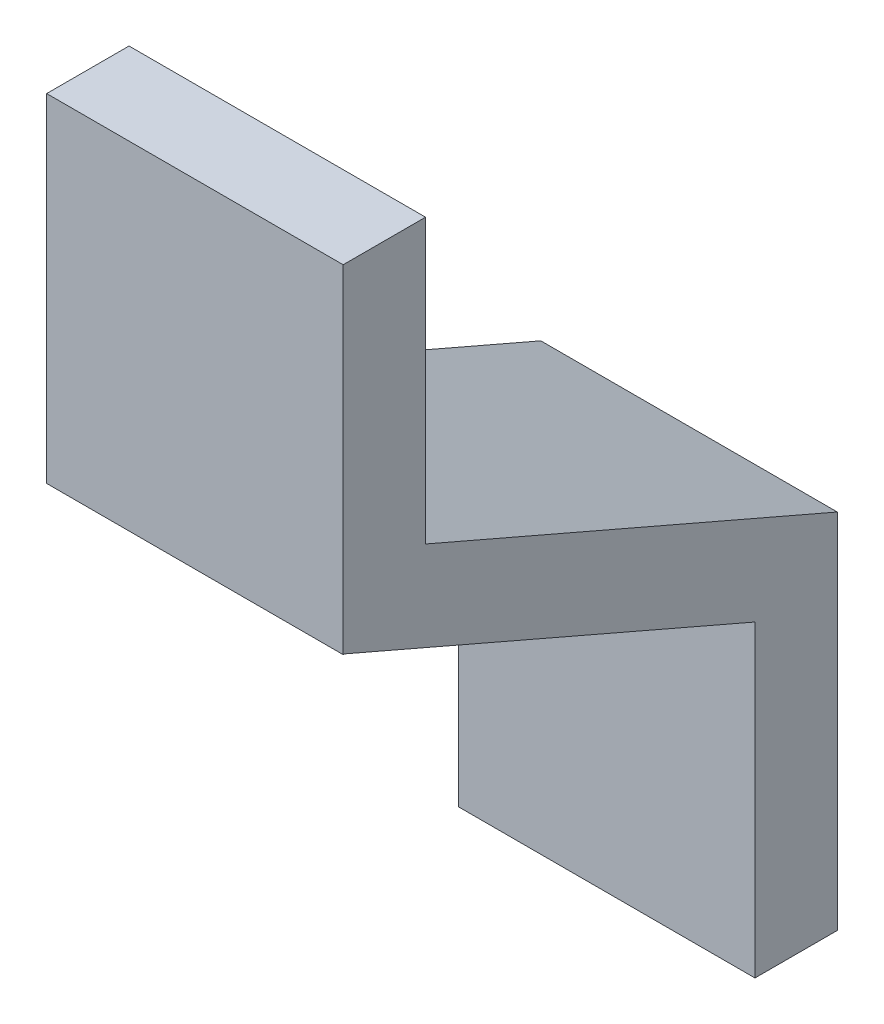
ISO-10303-21;
HEADER;
FILE_DESCRIPTION(('STEP AP214'),'2;1');
FILE_NAME('part.step','',(''),(''),'','','');
FILE_SCHEMA(('AUTOMOTIVE_DESIGN { 1 0 10303 214 1 1 1 1 }'));
ENDSEC;
DATA;
#1=APPLICATION_CONTEXT('core data for automotive mechanical design processes');
#2=APPLICATION_PROTOCOL_DEFINITION('international standard','automotive_design',2000,#1);
#3=PRODUCT_CONTEXT('',#1,'mechanical');
#4=PRODUCT('Part','Part','',(#3));
#5=PRODUCT_RELATED_PRODUCT_CATEGORY('part','',(#4));
#6=PRODUCT_DEFINITION_FORMATION('','',#4);
#7=PRODUCT_DEFINITION_CONTEXT('part definition',#1,'design');
#8=PRODUCT_DEFINITION('design','',#6,#7);
#9=PRODUCT_DEFINITION_SHAPE('','',#8);
#10=(LENGTH_UNIT() NAMED_UNIT(*) SI_UNIT(.MILLI.,.METRE.));
#11=(NAMED_UNIT(*) PLANE_ANGLE_UNIT() SI_UNIT($,.RADIAN.));
#12=(NAMED_UNIT(*) SI_UNIT($,.STERADIAN.) SOLID_ANGLE_UNIT());
#13=UNCERTAINTY_MEASURE_WITH_UNIT(LENGTH_MEASURE(1.E-05),#10,'distance_accuracy_value','');
#14=(GEOMETRIC_REPRESENTATION_CONTEXT(3) GLOBAL_UNCERTAINTY_ASSIGNED_CONTEXT((#13)) GLOBAL_UNIT_ASSIGNED_CONTEXT((#10,
#11,#12)) REPRESENTATION_CONTEXT('',''));
#15=CARTESIAN_POINT('',(0.,0.,0.));
#16=DIRECTION('',(0.,0.,1.));
#17=DIRECTION('',(1.,0.,0.));
#18=AXIS2_PLACEMENT_3D('',#15,#16,#17);
#19=CARTESIAN_POINT('',(3.42,0.999999996424,0.5));
#20=DIRECTION('',(0.,1.,0.));
#21=DIRECTION('',(0.,0.,1.));
#22=AXIS2_PLACEMENT_3D('',#19,#20,#21);
#23=PLANE('',#22);
#24=DIRECTION('',(1.,0.,0.));
#25=VECTOR('',#24,1.);
#26=CARTESIAN_POINT('',(3.42,0.999999996424,0.5));
#27=LINE('',#26,#25);
#28=CARTESIAN_POINT('',(3.780000014305,0.999999996424,0.5));
#29=VERTEX_POINT('',#28);
#30=CARTESIAN_POINT('',(3.42,0.999999996424,0.5));
#31=VERTEX_POINT('',#30);
#32=EDGE_CURVE('E140',#29,#31,#27,.F.);
#33=ORIENTED_EDGE('',*,*,#32,.T.);
#34=DIRECTION('',(0.,0.,-1.));
#35=VECTOR('',#34,1.);
#36=CARTESIAN_POINT('',(3.42,0.999999996424,0.));
#37=LINE('',#36,#35);
#38=CARTESIAN_POINT('',(3.42,0.999999996424,0.60000000149));
#39=VERTEX_POINT('',#38);
#40=EDGE_CURVE('E133',#31,#39,#37,.F.);
#41=ORIENTED_EDGE('',*,*,#40,.T.);
#42=DIRECTION('',(1.,0.,0.));
#43=VECTOR('',#42,1.);
#44=CARTESIAN_POINT('',(3.42,0.999999996424,0.60000000149));
#45=LINE('',#44,#43);
#46=CARTESIAN_POINT('',(3.780000014305,0.999999996424,0.60000000149));
#47=VERTEX_POINT('',#46);
#48=EDGE_CURVE('E129',#47,#39,#45,.F.);
#49=ORIENTED_EDGE('',*,*,#48,.F.);
#50=DIRECTION('',(0.,0.,-1.));
#51=VECTOR('',#50,1.);
#52=CARTESIAN_POINT('',(3.780000014305,0.999999996424,0.));
#53=LINE('',#52,#51);
#54=EDGE_CURVE('E106',#29,#47,#53,.F.);
#55=ORIENTED_EDGE('',*,*,#54,.F.);
#56=EDGE_LOOP('',(#33,#41,#49,#55));
#57=FACE_BOUND('',#56,.T.);
#58=ADVANCED_FACE('F17',(#57),#23,.T.);
#59=CARTESIAN_POINT('',(3.42,0.59,0.60000000149));
#60=DIRECTION('',(0.,0.,1.));
#61=DIRECTION('',(1.,0.,0.));
#62=AXIS2_PLACEMENT_3D('',#59,#60,#61);
#63=PLANE('',#62);
#64=DIRECTION('',(0.,1.,0.));
#65=VECTOR('',#64,1.);
#66=CARTESIAN_POINT('',(3.42,0.44,0.60000000149));
#67=LINE('',#66,#65);
#68=CARTESIAN_POINT('',(3.42,0.59,0.60000000149));
#69=VERTEX_POINT('',#68);
#70=EDGE_CURVE('E136',#39,#69,#67,.F.);
#71=ORIENTED_EDGE('',*,*,#70,.T.);
#72=DIRECTION('',(1.,0.,0.));
#73=VECTOR('',#72,1.);
#74=CARTESIAN_POINT('',(3.42,0.59,0.60000000149));
#75=LINE('',#74,#73);
#76=CARTESIAN_POINT('',(3.780000014305,0.59,0.60000000149));
#77=VERTEX_POINT('',#76);
#78=EDGE_CURVE('E92',#69,#77,#75,.T.);
#79=ORIENTED_EDGE('',*,*,#78,.T.);
#80=DIRECTION('',(0.,1.,0.));
#81=VECTOR('',#80,1.);
#82=CARTESIAN_POINT('',(3.780000014305,0.44,0.60000000149));
#83=LINE('',#82,#81);
#84=EDGE_CURVE('E73',#47,#77,#83,.F.);
#85=ORIENTED_EDGE('',*,*,#84,.F.);
#86=ORIENTED_EDGE('',*,*,#48,.T.);
#87=EDGE_LOOP('',(#71,#79,#85,#86));
#88=FACE_BOUND('',#87,.T.);
#89=ADVANCED_FACE('F285',(#88),#63,.T.);
#90=CARTESIAN_POINT('',(3.42,0.59,0.5));
#91=DIRECTION('',(0.,1.,0.));
#92=DIRECTION('',(0.,0.,1.));
#93=AXIS2_PLACEMENT_3D('',#90,#91,#92);
#94=PLANE('',#93);
#95=DIRECTION('',(1.,0.,0.));
#96=VECTOR('',#95,1.);
#97=CARTESIAN_POINT('',(3.42,0.590000000000416,0.59842599626982));
#98=LINE('',#97,#96);
#99=CARTESIAN_POINT('',(3.780000014305,0.590000000000104,0.598425996269911));
#100=VERTEX_POINT('',#99);
#101=CARTESIAN_POINT('',(3.42,0.590000000000104,0.59842599626991));
#102=VERTEX_POINT('',#101);
#103=EDGE_CURVE('E84',#100,#102,#98,.F.);
#104=ORIENTED_EDGE('',*,*,#103,.F.);
#105=DIRECTION('',(0.,0.,-1.));
#106=VECTOR('',#105,1.);
#107=CARTESIAN_POINT('',(3.780000014305,0.59,0.));
#108=LINE('',#107,#106);
#109=EDGE_CURVE('E20',#77,#100,#108,.T.);
#110=ORIENTED_EDGE('',*,*,#109,.F.);
#111=ORIENTED_EDGE('',*,*,#78,.F.);
#112=DIRECTION('',(0.,0.,1.));
#113=VECTOR('',#112,1.);
#114=CARTESIAN_POINT('',(3.42,0.59,0.5));
#115=LINE('',#114,#113);
#116=EDGE_CURVE('E87',#69,#102,#115,.F.);
#117=ORIENTED_EDGE('',*,*,#116,.T.);
#118=EDGE_LOOP('',(#104,#110,#111,#117));
#119=FACE_BOUND('',#118,.T.);
#120=ADVANCED_FACE('F85',(#119),#94,.F.);
#121=CARTESIAN_POINT('',(3.42,0.348224508223,0.03971472531736));
#122=DIRECTION('',(0.,-0.917754904098641,0.397147247255844));
#123=DIRECTION('',(0.,-0.397147247255844,-0.917754904098641));
#124=AXIS2_PLACEMENT_3D('',#121,#122,#123);
#125=PLANE('',#124);
#126=DIRECTION('',(0.,-0.397147247255413,-0.917754904098827));
#127=VECTOR('',#126,1.);
#128=CARTESIAN_POINT('',(3.780000014305,0.59,0.59842599627));
#129=LINE('',#128,#127);
#130=CARTESIAN_POINT('',(3.780000014305,0.37431222660502,0.10000000149));
#131=VERTEX_POINT('',#130);
#132=EDGE_CURVE('E80',#100,#131,#129,.T.);
#133=ORIENTED_EDGE('',*,*,#132,.F.);
#134=ORIENTED_EDGE('',*,*,#103,.T.);
#135=DIRECTION('',(0.,-0.397147247255413,-0.917754904098827));
#136=VECTOR('',#135,1.);
#137=CARTESIAN_POINT('',(3.42,0.59,0.59842599627));
#138=LINE('',#137,#136);
#139=CARTESIAN_POINT('',(3.42,0.374312226605,0.10000000149));
#140=VERTEX_POINT('',#139);
#141=EDGE_CURVE('E122',#102,#140,#138,.T.);
#142=ORIENTED_EDGE('',*,*,#141,.T.);
#143=DIRECTION('',(1.,0.,0.));
#144=VECTOR('',#143,1.);
#145=CARTESIAN_POINT('',(3.42,0.374312226605,0.10000000149));
#146=LINE('',#145,#144);
#147=EDGE_CURVE('E91',#131,#140,#146,.F.);
#148=ORIENTED_EDGE('',*,*,#147,.F.);
#149=EDGE_LOOP('',(#133,#134,#142,#148));
#150=FACE_BOUND('',#149,.T.);
#151=ADVANCED_FACE('F94',(#150),#125,.T.);
#152=CARTESIAN_POINT('',(3.42,0.,0.10000000149));
#153=DIRECTION('',(0.,0.,1.));
#154=DIRECTION('',(1.,0.,0.));
#155=AXIS2_PLACEMENT_3D('',#152,#153,#154);
#156=PLANE('',#155);
#157=ORIENTED_EDGE('',*,*,#147,.T.);
#158=DIRECTION('',(0.,1.,0.));
#159=VECTOR('',#158,1.);
#160=CARTESIAN_POINT('',(3.42,0.44,0.10000000149));
#161=LINE('',#160,#159);
#162=CARTESIAN_POINT('',(3.42,0.,0.10000000149));
#163=VERTEX_POINT('',#162);
#164=EDGE_CURVE('E118',#140,#163,#161,.F.);
#165=ORIENTED_EDGE('',*,*,#164,.T.);
#166=DIRECTION('',(1.,0.,0.));
#167=VECTOR('',#166,1.);
#168=CARTESIAN_POINT('',(3.42,0.,0.10000000149));
#169=LINE('',#168,#167);
#170=CARTESIAN_POINT('',(3.780000014305,0.,0.10000000149));
#171=VERTEX_POINT('',#170);
#172=EDGE_CURVE('E115',#163,#171,#169,.T.);
#173=ORIENTED_EDGE('',*,*,#172,.T.);
#174=DIRECTION('',(0.,1.,0.));
#175=VECTOR('',#174,1.);
#176=CARTESIAN_POINT('',(3.780000014305,0.44,0.10000000149));
#177=LINE('',#176,#175);
#178=EDGE_CURVE('E96',#131,#171,#177,.F.);
#179=ORIENTED_EDGE('',*,*,#178,.F.);
#180=EDGE_LOOP('',(#157,#165,#173,#179));
#181=FACE_BOUND('',#180,.T.);
#182=ADVANCED_FACE('F202',(#181),#156,.T.);
#183=CARTESIAN_POINT('',(3.42,0.,0.));
#184=DIRECTION('',(0.,1.,0.));
#185=DIRECTION('',(0.,0.,1.));
#186=AXIS2_PLACEMENT_3D('',#183,#184,#185);
#187=PLANE('',#186);
#188=DIRECTION('',(0.,0.,-1.));
#189=VECTOR('',#188,1.);
#190=CARTESIAN_POINT('',(3.42,0.,0.));
#191=LINE('',#190,#189);
#192=CARTESIAN_POINT('',(3.42,0.,0.));
#193=VERTEX_POINT('',#192);
#194=EDGE_CURVE('E121',#163,#193,#191,.T.);
#195=ORIENTED_EDGE('',*,*,#194,.T.);
#196=DIRECTION('',(1.,0.,0.));
#197=VECTOR('',#196,1.);
#198=CARTESIAN_POINT('',(3.42,0.,0.));
#199=LINE('',#198,#197);
#200=CARTESIAN_POINT('',(3.780000014305,0.,0.));
#201=VERTEX_POINT('',#200);
#202=EDGE_CURVE('E112',#193,#201,#199,.T.);
#203=ORIENTED_EDGE('',*,*,#202,.T.);
#204=DIRECTION('',(0.,0.,-1.));
#205=VECTOR('',#204,1.);
#206=CARTESIAN_POINT('',(3.780000014305,0.,0.));
#207=LINE('',#206,#205);
#208=EDGE_CURVE('E98',#171,#201,#207,.T.);
#209=ORIENTED_EDGE('',*,*,#208,.F.);
#210=ORIENTED_EDGE('',*,*,#172,.F.);
#211=EDGE_LOOP('',(#195,#203,#209,#210));
#212=FACE_BOUND('',#211,.T.);
#213=ADVANCED_FACE('F206',(#212),#187,.F.);
#214=CARTESIAN_POINT('',(3.42,0.,0.));
#215=DIRECTION('',(0.,0.,1.));
#216=DIRECTION('',(1.,0.,0.));
#217=AXIS2_PLACEMENT_3D('',#214,#215,#216);
#218=PLANE('',#217);
#219=ORIENTED_EDGE('',*,*,#202,.F.);
#220=DIRECTION('',(0.,1.,0.));
#221=VECTOR('',#220,1.);
#222=CARTESIAN_POINT('',(3.42,0.44,0.));
#223=LINE('',#222,#221);
#224=CARTESIAN_POINT('',(3.42,0.439999998997445,-1.94673175919965E-10));
#225=VERTEX_POINT('',#224);
#226=EDGE_CURVE('E178',#193,#225,#223,.T.);
#227=ORIENTED_EDGE('',*,*,#226,.T.);
#228=DIRECTION('',(1.,0.,0.));
#229=VECTOR('',#228,1.);
#230=CARTESIAN_POINT('',(3.42,0.43999999966303,-7.78692710220355E-10));
#231=LINE('',#230,#229);
#232=CARTESIAN_POINT('',(3.780000014305,0.439999998997445,-1.94673175919965E-10));
#233=VERTEX_POINT('',#232);
#234=EDGE_CURVE('E163',#225,#233,#231,.T.);
#235=ORIENTED_EDGE('',*,*,#234,.T.);
#236=DIRECTION('',(0.,1.,0.));
#237=VECTOR('',#236,1.);
#238=CARTESIAN_POINT('',(3.780000014305,0.44,0.));
#239=LINE('',#238,#237);
#240=EDGE_CURVE('E109',#201,#233,#239,.T.);
#241=ORIENTED_EDGE('',*,*,#240,.F.);
#242=EDGE_LOOP('',(#219,#227,#235,#241));
#243=FACE_BOUND('',#242,.T.);
#244=ADVANCED_FACE('F186',(#243),#218,.F.);
#245=CARTESIAN_POINT('',(3.780000014305,0.44,0.));
#246=DIRECTION('',(1.,0.,0.));
#247=DIRECTION('',(0.,0.,-1.));
#248=AXIS2_PLACEMENT_3D('',#245,#246,#247);
#249=PLANE('',#248);
#250=ORIENTED_EDGE('',*,*,#178,.T.);
#251=ORIENTED_EDGE('',*,*,#208,.T.);
#252=ORIENTED_EDGE('',*,*,#240,.T.);
#253=DIRECTION('',(0.,-0.397147247255844,-0.917754904098641));
#254=VECTOR('',#253,1.);
#255=CARTESIAN_POINT('',(3.780000014305,0.44,0.));
#256=LINE('',#255,#254);
#257=CARTESIAN_POINT('',(3.780000014305,0.656368904967003,0.499999999999999));
#258=VERTEX_POINT('',#257);
#259=EDGE_CURVE('E151',#233,#258,#256,.F.);
#260=ORIENTED_EDGE('',*,*,#259,.T.);
#261=DIRECTION('',(0.,1.,0.));
#262=VECTOR('',#261,1.);
#263=CARTESIAN_POINT('',(3.780000014305,0.59,0.5));
#264=LINE('',#263,#262);
#265=EDGE_CURVE('E144',#258,#29,#264,.T.);
#266=ORIENTED_EDGE('',*,*,#265,.T.);
#267=ORIENTED_EDGE('',*,*,#54,.T.);
#268=ORIENTED_EDGE('',*,*,#84,.T.);
#269=ORIENTED_EDGE('',*,*,#109,.T.);
#270=ORIENTED_EDGE('',*,*,#132,.T.);
#271=EDGE_LOOP('',(#250,#251,#252,#260,#266,#267,#268,#269,#270));
#272=FACE_BOUND('',#271,.T.);
#273=ADVANCED_FACE('F78',(#272),#249,.T.);
#274=CARTESIAN_POINT('',(3.42,0.59,0.5));
#275=DIRECTION('',(0.,0.,1.));
#276=DIRECTION('',(1.,0.,0.));
#277=AXIS2_PLACEMENT_3D('',#274,#275,#276);
#278=PLANE('',#277);
#279=ORIENTED_EDGE('',*,*,#265,.F.);
#280=DIRECTION('',(1.,0.,0.));
#281=VECTOR('',#280,1.);
#282=CARTESIAN_POINT('',(3.42,0.656368904967005,0.499999999999998));
#283=LINE('',#282,#281);
#284=CARTESIAN_POINT('',(3.42,0.656368904967001,0.5));
#285=VERTEX_POINT('',#284);
#286=EDGE_CURVE('E26',#258,#285,#283,.F.);
#287=ORIENTED_EDGE('',*,*,#286,.T.);
#288=DIRECTION('',(0.,1.,0.));
#289=VECTOR('',#288,1.);
#290=CARTESIAN_POINT('',(3.42,0.44,0.5));
#291=LINE('',#290,#289);
#292=EDGE_CURVE('E34',#285,#31,#291,.T.);
#293=ORIENTED_EDGE('',*,*,#292,.T.);
#294=ORIENTED_EDGE('',*,*,#32,.F.);
#295=EDGE_LOOP('',(#279,#287,#293,#294));
#296=FACE_BOUND('',#295,.T.);
#297=ADVANCED_FACE('F212',(#296),#278,.F.);
#298=CARTESIAN_POINT('',(3.42,0.44,0.));
#299=DIRECTION('',(1.,0.,0.));
#300=DIRECTION('',(0.,0.,-1.));
#301=AXIS2_PLACEMENT_3D('',#298,#299,#300);
#302=PLANE('',#301);
#303=ORIENTED_EDGE('',*,*,#226,.F.);
#304=ORIENTED_EDGE('',*,*,#194,.F.);
#305=ORIENTED_EDGE('',*,*,#164,.F.);
#306=ORIENTED_EDGE('',*,*,#141,.F.);
#307=ORIENTED_EDGE('',*,*,#116,.F.);
#308=ORIENTED_EDGE('',*,*,#70,.F.);
#309=ORIENTED_EDGE('',*,*,#40,.F.);
#310=ORIENTED_EDGE('',*,*,#292,.F.);
#311=DIRECTION('',(0.,-0.397147247255844,-0.917754904098641));
#312=VECTOR('',#311,1.);
#313=CARTESIAN_POINT('',(3.42,0.44,0.));
#314=LINE('',#313,#312);
#315=EDGE_CURVE('E11',#285,#225,#314,.T.);
#316=ORIENTED_EDGE('',*,*,#315,.T.);
#317=EDGE_LOOP('',(#303,#304,#305,#306,#307,#308,#309,#310,#316));
#318=FACE_BOUND('',#317,.T.);
#319=ADVANCED_FACE('F207',(#318),#302,.F.);
#320=CARTESIAN_POINT('',(3.42,0.44,0.));
#321=DIRECTION('',(0.,-0.917754904098641,0.397147247255844));
#322=DIRECTION('',(0.,-0.397147247255844,-0.917754904098641));
#323=AXIS2_PLACEMENT_3D('',#320,#321,#322);
#324=PLANE('',#323);
#325=ORIENTED_EDGE('',*,*,#286,.F.);
#326=ORIENTED_EDGE('',*,*,#259,.F.);
#327=ORIENTED_EDGE('',*,*,#234,.F.);
#328=ORIENTED_EDGE('',*,*,#315,.F.);
#329=EDGE_LOOP('',(#325,#326,#327,#328));
#330=FACE_BOUND('',#329,.T.);
#331=ADVANCED_FACE('F193',(#330),#324,.F.);
#332=CLOSED_SHELL('',(#58,#89,#120,#151,#182,#213,#244,#273,#297,#319,#331));
#333=MANIFOLD_SOLID_BREP('B1',#332);
#334=ADVANCED_BREP_SHAPE_REPRESENTATION('',(#18,#333),#14);
#335=SHAPE_DEFINITION_REPRESENTATION(#9,#334);
ENDSEC;
END-ISO-10303-21;
